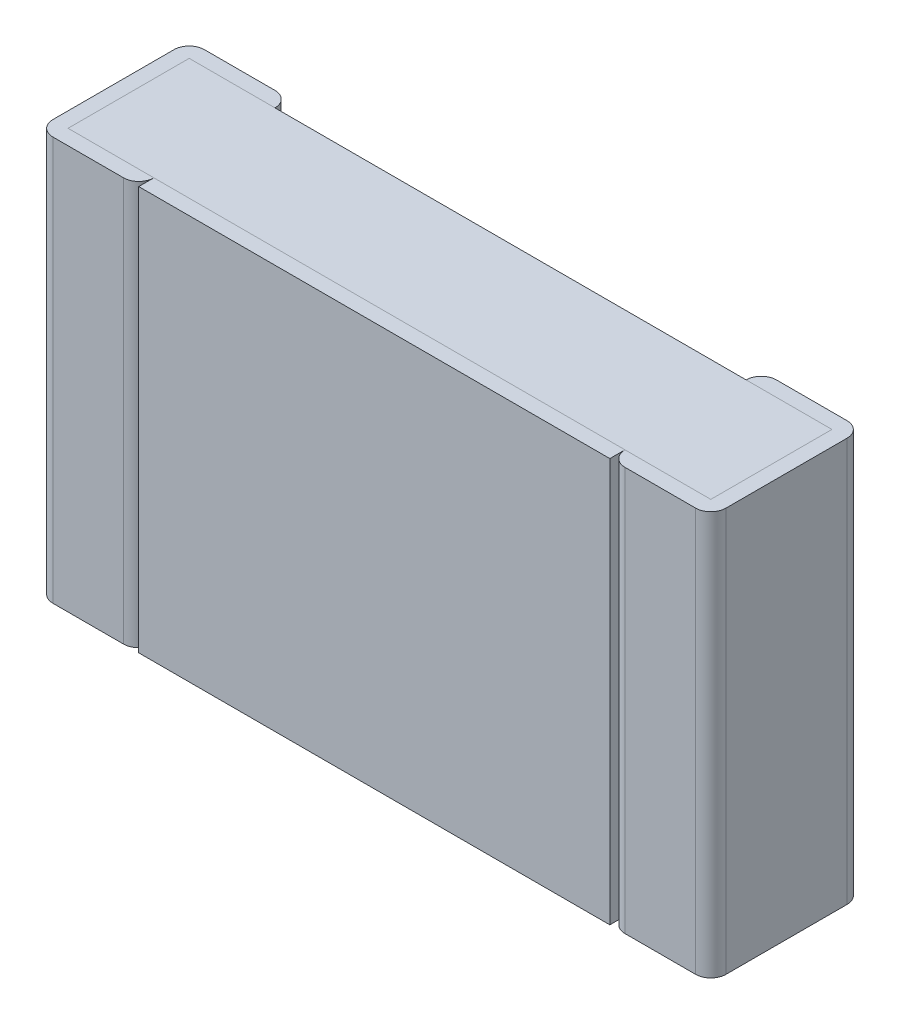
ISO-10303-21;
HEADER;
FILE_DESCRIPTION(('STEP AP214'),'2;1');
FILE_NAME('part.step','',(''),(''),'','','');
FILE_SCHEMA(('AUTOMOTIVE_DESIGN { 1 0 10303 214 1 1 1 1 }'));
ENDSEC;
DATA;
#1=APPLICATION_CONTEXT('core data for automotive mechanical design processes');
#2=APPLICATION_PROTOCOL_DEFINITION('international standard','automotive_design',2000,#1);
#3=PRODUCT_CONTEXT('',#1,'mechanical');
#4=PRODUCT('Part','Part','',(#3));
#5=PRODUCT_RELATED_PRODUCT_CATEGORY('part','',(#4));
#6=PRODUCT_DEFINITION_FORMATION('','',#4);
#7=PRODUCT_DEFINITION_CONTEXT('part definition',#1,'design');
#8=PRODUCT_DEFINITION('design','',#6,#7);
#9=PRODUCT_DEFINITION_SHAPE('','',#8);
#10=(LENGTH_UNIT() NAMED_UNIT(*) SI_UNIT(.MILLI.,.METRE.));
#11=(NAMED_UNIT(*) PLANE_ANGLE_UNIT() SI_UNIT($,.RADIAN.));
#12=(NAMED_UNIT(*) SI_UNIT($,.STERADIAN.) SOLID_ANGLE_UNIT());
#13=UNCERTAINTY_MEASURE_WITH_UNIT(LENGTH_MEASURE(1.E-05),#10,'distance_accuracy_value','');
#14=(GEOMETRIC_REPRESENTATION_CONTEXT(3) GLOBAL_UNCERTAINTY_ASSIGNED_CONTEXT((#13)) GLOBAL_UNIT_ASSIGNED_CONTEXT((#10,
#11,#12)) REPRESENTATION_CONTEXT('',''));
#15=CARTESIAN_POINT('',(0.,0.,0.));
#16=DIRECTION('',(0.,0.,1.));
#17=DIRECTION('',(1.,0.,0.));
#18=AXIS2_PLACEMENT_3D('',#15,#16,#17);
#19=CARTESIAN_POINT('',(-1.,-0.6,0.));
#20=DIRECTION('',(1.,0.,0.));
#21=DIRECTION('',(0.,1.,0.));
#22=AXIS2_PLACEMENT_3D('',#19,#20,#21);
#23=PLANE('',#22);
#24=DIRECTION('',(0.,1.,0.));
#25=VECTOR('',#24,1.);
#26=CARTESIAN_POINT('',(-1.,-0.6,0.405));
#27=LINE('',#26,#25);
#28=CARTESIAN_POINT('',(-1.,-0.6,0.405));
#29=VERTEX_POINT('',#28);
#30=CARTESIAN_POINT('',(-1.,0.6,0.405));
#31=VERTEX_POINT('',#30);
#32=EDGE_CURVE('E11',#29,#31,#27,.T.);
#33=ORIENTED_EDGE('',*,*,#32,.T.);
#34=DIRECTION('',(0.,0.,1.));
#35=VECTOR('',#34,1.);
#36=CARTESIAN_POINT('',(-1.,0.6,0.));
#37=LINE('',#36,#35);
#38=CARTESIAN_POINT('',(-1.,0.6,0.045));
#39=VERTEX_POINT('',#38);
#40=EDGE_CURVE('E41',#39,#31,#37,.T.);
#41=ORIENTED_EDGE('',*,*,#40,.F.);
#42=DIRECTION('',(0.,1.,0.));
#43=VECTOR('',#42,1.);
#44=CARTESIAN_POINT('',(-1.,-0.6,0.045));
#45=LINE('',#44,#43);
#46=CARTESIAN_POINT('',(-1.,-0.6,0.045));
#47=VERTEX_POINT('',#46);
#48=EDGE_CURVE('E234',#47,#39,#45,.T.);
#49=ORIENTED_EDGE('',*,*,#48,.F.);
#50=DIRECTION('',(0.,0.,1.));
#51=VECTOR('',#50,1.);
#52=CARTESIAN_POINT('',(-1.,-0.6,0.));
#53=LINE('',#52,#51);
#54=EDGE_CURVE('E27',#47,#29,#53,.T.);
#55=ORIENTED_EDGE('',*,*,#54,.T.);
#56=EDGE_LOOP('',(#33,#41,#49,#55));
#57=FACE_BOUND('',#56,.T.);
#58=ADVANCED_FACE('F16',(#57),#23,.F.);
#59=CARTESIAN_POINT('',(-1.,-0.6,0.));
#60=DIRECTION('',(0.,1.,0.));
#61=DIRECTION('',(1.,0.,0.));
#62=AXIS2_PLACEMENT_3D('',#59,#60,#61);
#63=PLANE('',#62);
#64=CARTESIAN_POINT('',(-0.745,-0.6,0.045));
#65=DIRECTION('',(0.,1.,0.));
#66=DIRECTION('',(0.,0.,1.));
#67=AXIS2_PLACEMENT_3D('',#64,#65,#66);
#68=CIRCLE('',#67,0.045);
#69=CARTESIAN_POINT('',(-0.7,-0.6,0.045));
#70=VERTEX_POINT('',#69);
#71=CARTESIAN_POINT('',(-0.745,-0.6,0.));
#72=VERTEX_POINT('',#71);
#73=EDGE_CURVE('E257',#70,#72,#68,.T.);
#74=ORIENTED_EDGE('',*,*,#73,.F.);
#75=DIRECTION('',(1.,0.,0.));
#76=VECTOR('',#75,1.);
#77=CARTESIAN_POINT('',(-0.955,-0.6,0.045));
#78=LINE('',#77,#76);
#79=CARTESIAN_POINT('',(-0.955,-0.6,0.045));
#80=VERTEX_POINT('',#79);
#81=EDGE_CURVE('E186',#80,#70,#78,.T.);
#82=ORIENTED_EDGE('',*,*,#81,.F.);
#83=DIRECTION('',(0.,0.,1.));
#84=VECTOR('',#83,1.);
#85=CARTESIAN_POINT('',(-0.955,-0.6,0.045));
#86=LINE('',#85,#84);
#87=CARTESIAN_POINT('',(-0.955,-0.6,0.405));
#88=VERTEX_POINT('',#87);
#89=EDGE_CURVE('E311',#80,#88,#86,.T.);
#90=ORIENTED_EDGE('',*,*,#89,.T.);
#91=DIRECTION('',(1.,0.,0.));
#92=VECTOR('',#91,1.);
#93=CARTESIAN_POINT('',(-0.955,-0.6,0.405));
#94=LINE('',#93,#92);
#95=CARTESIAN_POINT('',(-0.7,-0.6,0.405));
#96=VERTEX_POINT('',#95);
#97=EDGE_CURVE('E308',#88,#96,#94,.T.);
#98=ORIENTED_EDGE('',*,*,#97,.T.);
#99=CARTESIAN_POINT('',(-0.745,-0.6,0.405));
#100=DIRECTION('',(0.,-1.,0.));
#101=DIRECTION('',(0.,0.,1.));
#102=AXIS2_PLACEMENT_3D('',#99,#100,#101);
#103=CIRCLE('',#102,0.045);
#104=CARTESIAN_POINT('',(-0.745,-0.6,0.45));
#105=VERTEX_POINT('',#104);
#106=EDGE_CURVE('E180',#96,#105,#103,.T.);
#107=ORIENTED_EDGE('',*,*,#106,.T.);
#108=DIRECTION('',(1.,0.,0.));
#109=VECTOR('',#108,1.);
#110=CARTESIAN_POINT('',(-1.,-0.6,0.45));
#111=LINE('',#110,#109);
#112=CARTESIAN_POINT('',(-0.955,-0.6,0.45));
#113=VERTEX_POINT('',#112);
#114=EDGE_CURVE('E172',#113,#105,#111,.T.);
#115=ORIENTED_EDGE('',*,*,#114,.F.);
#116=CARTESIAN_POINT('',(-0.955,-0.6,0.405));
#117=DIRECTION('',(0.,1.,0.));
#118=DIRECTION('',(0.,0.,1.));
#119=AXIS2_PLACEMENT_3D('',#116,#117,#118);
#120=CIRCLE('',#119,0.045);
#121=EDGE_CURVE('E177',#29,#113,#120,.T.);
#122=ORIENTED_EDGE('',*,*,#121,.F.);
#123=ORIENTED_EDGE('',*,*,#54,.F.);
#124=CARTESIAN_POINT('',(-0.955,-0.6,0.045));
#125=DIRECTION('',(0.,-1.,0.));
#126=DIRECTION('',(0.,0.,1.));
#127=AXIS2_PLACEMENT_3D('',#124,#125,#126);
#128=CIRCLE('',#127,0.045);
#129=CARTESIAN_POINT('',(-0.955,-0.6,0.));
#130=VERTEX_POINT('',#129);
#131=EDGE_CURVE('E357',#47,#130,#128,.T.);
#132=ORIENTED_EDGE('',*,*,#131,.T.);
#133=DIRECTION('',(1.,0.,0.));
#134=VECTOR('',#133,1.);
#135=CARTESIAN_POINT('',(-1.,-0.6,0.));
#136=LINE('',#135,#134);
#137=EDGE_CURVE('E164',#130,#72,#136,.T.);
#138=ORIENTED_EDGE('',*,*,#137,.T.);
#139=EDGE_LOOP('',(#74,#82,#90,#98,#107,#115,#122,#123,#132,#138));
#140=FACE_BOUND('',#139,.T.);
#141=ADVANCED_FACE('F175',(#140),#63,.F.);
#142=CARTESIAN_POINT('',(-0.955,-0.6,0.045));
#143=DIRECTION('',(0.,1.,0.));
#144=DIRECTION('',(-1.,0.,0.));
#145=AXIS2_PLACEMENT_3D('',#142,#143,#144);
#146=CYLINDRICAL_SURFACE('',#145,0.045);
#147=ORIENTED_EDGE('',*,*,#48,.T.);
#148=CARTESIAN_POINT('',(-0.955,0.6,0.045));
#149=DIRECTION('',(0.,-1.,0.));
#150=DIRECTION('',(0.,0.,1.));
#151=AXIS2_PLACEMENT_3D('',#148,#149,#150);
#152=CIRCLE('',#151,0.045);
#153=CARTESIAN_POINT('',(-0.955,0.6,0.));
#154=VERTEX_POINT('',#153);
#155=EDGE_CURVE('E197',#39,#154,#152,.T.);
#156=ORIENTED_EDGE('',*,*,#155,.T.);
#157=DIRECTION('',(0.,1.,0.));
#158=VECTOR('',#157,1.);
#159=CARTESIAN_POINT('',(-0.955,-0.6,0.));
#160=LINE('',#159,#158);
#161=EDGE_CURVE('E256',#130,#154,#160,.T.);
#162=ORIENTED_EDGE('',*,*,#161,.F.);
#163=ORIENTED_EDGE('',*,*,#131,.F.);
#164=EDGE_LOOP('',(#147,#156,#162,#163));
#165=FACE_BOUND('',#164,.T.);
#166=ADVANCED_FACE('F429',(#165),#146,.T.);
#167=CARTESIAN_POINT('',(-0.955,-0.6,0.405));
#168=DIRECTION('',(0.,1.,0.));
#169=DIRECTION('',(-1.,0.,0.));
#170=AXIS2_PLACEMENT_3D('',#167,#168,#169);
#171=CYLINDRICAL_SURFACE('',#170,0.045);
#172=ORIENTED_EDGE('',*,*,#121,.T.);
#173=DIRECTION('',(0.,1.,0.));
#174=VECTOR('',#173,1.);
#175=CARTESIAN_POINT('',(-0.955,-0.6,0.45));
#176=LINE('',#175,#174);
#177=CARTESIAN_POINT('',(-0.955,0.6,0.45));
#178=VERTEX_POINT('',#177);
#179=EDGE_CURVE('E194',#113,#178,#176,.T.);
#180=ORIENTED_EDGE('',*,*,#179,.T.);
#181=CARTESIAN_POINT('',(-0.955,0.6,0.405));
#182=DIRECTION('',(0.,1.,0.));
#183=DIRECTION('',(0.,0.,1.));
#184=AXIS2_PLACEMENT_3D('',#181,#182,#183);
#185=CIRCLE('',#184,0.045);
#186=EDGE_CURVE('E208',#31,#178,#185,.T.);
#187=ORIENTED_EDGE('',*,*,#186,.F.);
#188=ORIENTED_EDGE('',*,*,#32,.F.);
#189=EDGE_LOOP('',(#172,#180,#187,#188));
#190=FACE_BOUND('',#189,.T.);
#191=ADVANCED_FACE('F192',(#190),#171,.T.);
#192=CARTESIAN_POINT('',(-1.,0.6,0.));
#193=DIRECTION('',(0.,1.,0.));
#194=DIRECTION('',(1.,0.,0.));
#195=AXIS2_PLACEMENT_3D('',#192,#193,#194);
#196=PLANE('',#195);
#197=DIRECTION('',(1.,0.,0.));
#198=VECTOR('',#197,1.);
#199=CARTESIAN_POINT('',(-1.,0.6,0.));
#200=LINE('',#199,#198);
#201=CARTESIAN_POINT('',(-0.745,0.6,0.));
#202=VERTEX_POINT('',#201);
#203=EDGE_CURVE('E253',#154,#202,#200,.T.);
#204=ORIENTED_EDGE('',*,*,#203,.F.);
#205=ORIENTED_EDGE('',*,*,#155,.F.);
#206=ORIENTED_EDGE('',*,*,#40,.T.);
#207=ORIENTED_EDGE('',*,*,#186,.T.);
#208=DIRECTION('',(1.,0.,0.));
#209=VECTOR('',#208,1.);
#210=CARTESIAN_POINT('',(-1.,0.6,0.45));
#211=LINE('',#210,#209);
#212=CARTESIAN_POINT('',(-0.745,0.6,0.45));
#213=VERTEX_POINT('',#212);
#214=EDGE_CURVE('E201',#178,#213,#211,.T.);
#215=ORIENTED_EDGE('',*,*,#214,.T.);
#216=CARTESIAN_POINT('',(-0.745,0.6,0.405));
#217=DIRECTION('',(0.,-1.,0.));
#218=DIRECTION('',(0.,0.,1.));
#219=AXIS2_PLACEMENT_3D('',#216,#217,#218);
#220=CIRCLE('',#219,0.045);
#221=CARTESIAN_POINT('',(-0.7,0.6,0.405));
#222=VERTEX_POINT('',#221);
#223=EDGE_CURVE('E268',#222,#213,#220,.T.);
#224=ORIENTED_EDGE('',*,*,#223,.F.);
#225=DIRECTION('',(1.,0.,0.));
#226=VECTOR('',#225,1.);
#227=CARTESIAN_POINT('',(-0.955,0.6,0.405));
#228=LINE('',#227,#226);
#229=CARTESIAN_POINT('',(-0.955,0.6,0.405));
#230=VERTEX_POINT('',#229);
#231=EDGE_CURVE('E245',#230,#222,#228,.T.);
#232=ORIENTED_EDGE('',*,*,#231,.F.);
#233=DIRECTION('',(0.,0.,1.));
#234=VECTOR('',#233,1.);
#235=CARTESIAN_POINT('',(-0.955,0.6,0.045));
#236=LINE('',#235,#234);
#237=CARTESIAN_POINT('',(-0.955,0.6,0.045));
#238=VERTEX_POINT('',#237);
#239=EDGE_CURVE('E272',#238,#230,#236,.T.);
#240=ORIENTED_EDGE('',*,*,#239,.F.);
#241=DIRECTION('',(1.,0.,0.));
#242=VECTOR('',#241,1.);
#243=CARTESIAN_POINT('',(-0.955,0.6,0.045));
#244=LINE('',#243,#242);
#245=CARTESIAN_POINT('',(-0.7,0.6,0.045));
#246=VERTEX_POINT('',#245);
#247=EDGE_CURVE('E410',#238,#246,#244,.T.);
#248=ORIENTED_EDGE('',*,*,#247,.T.);
#249=CARTESIAN_POINT('',(-0.745,0.6,0.045));
#250=DIRECTION('',(0.,1.,0.));
#251=DIRECTION('',(0.,0.,1.));
#252=AXIS2_PLACEMENT_3D('',#249,#250,#251);
#253=CIRCLE('',#252,0.045);
#254=EDGE_CURVE('E339',#246,#202,#253,.T.);
#255=ORIENTED_EDGE('',*,*,#254,.T.);
#256=EDGE_LOOP('',(#204,#205,#206,#207,#215,#224,#232,#240,#248,#255));
#257=FACE_BOUND('',#256,.T.);
#258=ADVANCED_FACE('F422',(#257),#196,.T.);
#259=CARTESIAN_POINT('',(-1.,-0.6,0.));
#260=DIRECTION('',(0.,0.,1.));
#261=DIRECTION('',(1.,0.,0.));
#262=AXIS2_PLACEMENT_3D('',#259,#260,#261);
#263=PLANE('',#262);
#264=DIRECTION('',(0.,1.,0.));
#265=VECTOR('',#264,1.);
#266=CARTESIAN_POINT('',(-0.745,-0.6,0.));
#267=LINE('',#266,#265);
#268=EDGE_CURVE('E263',#72,#202,#267,.T.);
#269=ORIENTED_EDGE('',*,*,#268,.F.);
#270=ORIENTED_EDGE('',*,*,#137,.F.);
#271=ORIENTED_EDGE('',*,*,#161,.T.);
#272=ORIENTED_EDGE('',*,*,#203,.T.);
#273=EDGE_LOOP('',(#269,#270,#271,#272));
#274=FACE_BOUND('',#273,.T.);
#275=ADVANCED_FACE('F425',(#274),#263,.F.);
#276=CARTESIAN_POINT('',(-0.745,-0.6,0.045));
#277=DIRECTION('',(0.,1.,0.));
#278=DIRECTION('',(1.,0.,0.));
#279=AXIS2_PLACEMENT_3D('',#276,#277,#278);
#280=CYLINDRICAL_SURFACE('',#279,0.045);
#281=ORIENTED_EDGE('',*,*,#73,.T.);
#282=ORIENTED_EDGE('',*,*,#268,.T.);
#283=ORIENTED_EDGE('',*,*,#254,.F.);
#284=DIRECTION('',(0.,1.,0.));
#285=VECTOR('',#284,1.);
#286=CARTESIAN_POINT('',(-0.7,-0.6,0.045));
#287=LINE('',#286,#285);
#288=EDGE_CURVE('E239',#70,#246,#287,.T.);
#289=ORIENTED_EDGE('',*,*,#288,.F.);
#290=EDGE_LOOP('',(#281,#282,#283,#289));
#291=FACE_BOUND('',#290,.T.);
#292=ADVANCED_FACE('F424',(#291),#280,.T.);
#293=CARTESIAN_POINT('',(-0.955,-0.6,0.045));
#294=DIRECTION('',(0.,1.,0.));
#295=DIRECTION('',(1.,0.,0.));
#296=AXIS2_PLACEMENT_3D('',#293,#294,#295);
#297=PLANE('',#296);
#298=DIRECTION('',(1.,0.,0.));
#299=VECTOR('',#298,1.);
#300=CARTESIAN_POINT('',(-0.955,-0.6,0.045));
#301=LINE('',#300,#299);
#302=CARTESIAN_POINT('',(0.7,-0.6,0.045));
#303=VERTEX_POINT('',#302);
#304=EDGE_CURVE('E267',#70,#303,#301,.T.);
#305=ORIENTED_EDGE('',*,*,#304,.T.);
#306=DIRECTION('',(1.,0.,0.));
#307=VECTOR('',#306,1.);
#308=CARTESIAN_POINT('',(-0.955,-0.6,0.045));
#309=LINE('',#308,#307);
#310=CARTESIAN_POINT('',(0.955,-0.6,0.045));
#311=VERTEX_POINT('',#310);
#312=EDGE_CURVE('E365',#303,#311,#309,.T.);
#313=ORIENTED_EDGE('',*,*,#312,.T.);
#314=DIRECTION('',(0.,0.,1.));
#315=VECTOR('',#314,1.);
#316=CARTESIAN_POINT('',(0.955,-0.6,0.045));
#317=LINE('',#316,#315);
#318=CARTESIAN_POINT('',(0.955,-0.6,0.405));
#319=VERTEX_POINT('',#318);
#320=EDGE_CURVE('E368',#311,#319,#317,.T.);
#321=ORIENTED_EDGE('',*,*,#320,.T.);
#322=DIRECTION('',(1.,0.,0.));
#323=VECTOR('',#322,1.);
#324=CARTESIAN_POINT('',(-0.955,-0.6,0.405));
#325=LINE('',#324,#323);
#326=CARTESIAN_POINT('',(0.7,-0.6,0.405));
#327=VERTEX_POINT('',#326);
#328=EDGE_CURVE('E283',#327,#319,#325,.T.);
#329=ORIENTED_EDGE('',*,*,#328,.F.);
#330=DIRECTION('',(1.,0.,0.));
#331=VECTOR('',#330,1.);
#332=CARTESIAN_POINT('',(-0.7,-0.6,0.405));
#333=LINE('',#332,#331);
#334=EDGE_CURVE('E306',#96,#327,#333,.T.);
#335=ORIENTED_EDGE('',*,*,#334,.F.);
#336=ORIENTED_EDGE('',*,*,#97,.F.);
#337=ORIENTED_EDGE('',*,*,#89,.F.);
#338=ORIENTED_EDGE('',*,*,#81,.T.);
#339=EDGE_LOOP('',(#305,#313,#321,#329,#335,#336,#337,#338));
#340=FACE_BOUND('',#339,.T.);
#341=ADVANCED_FACE('F478',(#340),#297,.F.);
#342=CARTESIAN_POINT('',(-1.,-0.6,0.45));
#343=DIRECTION('',(0.,0.,1.));
#344=DIRECTION('',(1.,0.,0.));
#345=AXIS2_PLACEMENT_3D('',#342,#343,#344);
#346=PLANE('',#345);
#347=ORIENTED_EDGE('',*,*,#214,.F.);
#348=ORIENTED_EDGE('',*,*,#179,.F.);
#349=ORIENTED_EDGE('',*,*,#114,.T.);
#350=DIRECTION('',(0.,1.,0.));
#351=VECTOR('',#350,1.);
#352=CARTESIAN_POINT('',(-0.745,-0.6,0.45));
#353=LINE('',#352,#351);
#354=EDGE_CURVE('E187',#105,#213,#353,.T.);
#355=ORIENTED_EDGE('',*,*,#354,.T.);
#356=EDGE_LOOP('',(#347,#348,#349,#355));
#357=FACE_BOUND('',#356,.T.);
#358=ADVANCED_FACE('F199',(#357),#346,.T.);
#359=CARTESIAN_POINT('',(-0.745,-0.6,0.405));
#360=DIRECTION('',(0.,1.,0.));
#361=DIRECTION('',(1.,0.,0.));
#362=AXIS2_PLACEMENT_3D('',#359,#360,#361);
#363=CYLINDRICAL_SURFACE('',#362,0.045);
#364=DIRECTION('',(0.,1.,0.));
#365=VECTOR('',#364,1.);
#366=CARTESIAN_POINT('',(-0.7,-0.6,0.405));
#367=LINE('',#366,#365);
#368=EDGE_CURVE('E271',#96,#222,#367,.T.);
#369=ORIENTED_EDGE('',*,*,#368,.T.);
#370=ORIENTED_EDGE('',*,*,#223,.T.);
#371=ORIENTED_EDGE('',*,*,#354,.F.);
#372=ORIENTED_EDGE('',*,*,#106,.F.);
#373=EDGE_LOOP('',(#369,#370,#371,#372));
#374=FACE_BOUND('',#373,.T.);
#375=ADVANCED_FACE('F511',(#374),#363,.T.);
#376=CARTESIAN_POINT('',(-0.955,0.6,0.045));
#377=DIRECTION('',(0.,1.,0.));
#378=DIRECTION('',(1.,0.,0.));
#379=AXIS2_PLACEMENT_3D('',#376,#377,#378);
#380=PLANE('',#379);
#381=ORIENTED_EDGE('',*,*,#247,.F.);
#382=ORIENTED_EDGE('',*,*,#239,.T.);
#383=ORIENTED_EDGE('',*,*,#231,.T.);
#384=DIRECTION('',(1.,0.,0.));
#385=VECTOR('',#384,1.);
#386=CARTESIAN_POINT('',(-0.7,0.6,0.405));
#387=LINE('',#386,#385);
#388=CARTESIAN_POINT('',(0.7,0.6,0.405));
#389=VERTEX_POINT('',#388);
#390=EDGE_CURVE('E241',#222,#389,#387,.T.);
#391=ORIENTED_EDGE('',*,*,#390,.T.);
#392=DIRECTION('',(1.,0.,0.));
#393=VECTOR('',#392,1.);
#394=CARTESIAN_POINT('',(-0.955,0.6,0.405));
#395=LINE('',#394,#393);
#396=CARTESIAN_POINT('',(0.955,0.6,0.405));
#397=VERTEX_POINT('',#396);
#398=EDGE_CURVE('E246',#389,#397,#395,.T.);
#399=ORIENTED_EDGE('',*,*,#398,.T.);
#400=DIRECTION('',(0.,0.,1.));
#401=VECTOR('',#400,1.);
#402=CARTESIAN_POINT('',(0.955,0.6,0.045));
#403=LINE('',#402,#401);
#404=CARTESIAN_POINT('',(0.955,0.6,0.045));
#405=VERTEX_POINT('',#404);
#406=EDGE_CURVE('E230',#405,#397,#403,.T.);
#407=ORIENTED_EDGE('',*,*,#406,.F.);
#408=DIRECTION('',(1.,0.,0.));
#409=VECTOR('',#408,1.);
#410=CARTESIAN_POINT('',(-0.955,0.6,0.045));
#411=LINE('',#410,#409);
#412=CARTESIAN_POINT('',(0.7,0.6,0.045));
#413=VERTEX_POINT('',#412);
#414=EDGE_CURVE('E315',#413,#405,#411,.T.);
#415=ORIENTED_EDGE('',*,*,#414,.F.);
#416=DIRECTION('',(1.,0.,0.));
#417=VECTOR('',#416,1.);
#418=CARTESIAN_POINT('',(-0.955,0.6,0.045));
#419=LINE('',#418,#417);
#420=EDGE_CURVE('E376',#246,#413,#419,.T.);
#421=ORIENTED_EDGE('',*,*,#420,.F.);
#422=EDGE_LOOP('',(#381,#382,#383,#391,#399,#407,#415,#421));
#423=FACE_BOUND('',#422,.T.);
#424=ADVANCED_FACE('F492',(#423),#380,.T.);
#425=CARTESIAN_POINT('',(-0.955,-0.6,0.045));
#426=DIRECTION('',(0.,0.,1.));
#427=DIRECTION('',(1.,0.,0.));
#428=AXIS2_PLACEMENT_3D('',#425,#426,#427);
#429=PLANE('',#428);
#430=ORIENTED_EDGE('',*,*,#420,.T.);
#431=DIRECTION('',(0.,1.,0.));
#432=VECTOR('',#431,1.);
#433=CARTESIAN_POINT('',(0.7,-0.6,0.045));
#434=LINE('',#433,#432);
#435=EDGE_CURVE('E221',#303,#413,#434,.T.);
#436=ORIENTED_EDGE('',*,*,#435,.F.);
#437=ORIENTED_EDGE('',*,*,#304,.F.);
#438=ORIENTED_EDGE('',*,*,#288,.T.);
#439=EDGE_LOOP('',(#430,#436,#437,#438));
#440=FACE_BOUND('',#439,.T.);
#441=ADVANCED_FACE('F517',(#440),#429,.F.);
#442=CARTESIAN_POINT('',(0.7,-0.6,0.));
#443=DIRECTION('',(0.,1.,0.));
#444=DIRECTION('',(1.,0.,0.));
#445=AXIS2_PLACEMENT_3D('',#442,#443,#444);
#446=PLANE('',#445);
#447=CARTESIAN_POINT('',(0.955,-0.6,0.045));
#448=DIRECTION('',(0.,1.,0.));
#449=DIRECTION('',(0.,0.,1.));
#450=AXIS2_PLACEMENT_3D('',#447,#448,#449);
#451=CIRCLE('',#450,0.045);
#452=CARTESIAN_POINT('',(1.,-0.6,0.045));
#453=VERTEX_POINT('',#452);
#454=CARTESIAN_POINT('',(0.955,-0.6,0.));
#455=VERTEX_POINT('',#454);
#456=EDGE_CURVE('E258',#453,#455,#451,.T.);
#457=ORIENTED_EDGE('',*,*,#456,.F.);
#458=DIRECTION('',(0.,0.,1.));
#459=VECTOR('',#458,1.);
#460=CARTESIAN_POINT('',(1.,-0.6,0.));
#461=LINE('',#460,#459);
#462=CARTESIAN_POINT('',(1.,-0.6,0.405));
#463=VERTEX_POINT('',#462);
#464=EDGE_CURVE('E235',#453,#463,#461,.T.);
#465=ORIENTED_EDGE('',*,*,#464,.T.);
#466=CARTESIAN_POINT('',(0.955,-0.6,0.405));
#467=DIRECTION('',(0.,-1.,0.));
#468=DIRECTION('',(0.,0.,1.));
#469=AXIS2_PLACEMENT_3D('',#466,#467,#468);
#470=CIRCLE('',#469,0.045);
#471=CARTESIAN_POINT('',(0.955,-0.6,0.45));
#472=VERTEX_POINT('',#471);
#473=EDGE_CURVE('E240',#463,#472,#470,.T.);
#474=ORIENTED_EDGE('',*,*,#473,.T.);
#475=DIRECTION('',(1.,0.,0.));
#476=VECTOR('',#475,1.);
#477=CARTESIAN_POINT('',(0.7,-0.6,0.45));
#478=LINE('',#477,#476);
#479=CARTESIAN_POINT('',(0.745,-0.6,0.45));
#480=VERTEX_POINT('',#479);
#481=EDGE_CURVE('E252',#480,#472,#478,.T.);
#482=ORIENTED_EDGE('',*,*,#481,.F.);
#483=CARTESIAN_POINT('',(0.745,-0.6,0.405));
#484=DIRECTION('',(0.,1.,0.));
#485=DIRECTION('',(0.,0.,1.));
#486=AXIS2_PLACEMENT_3D('',#483,#484,#485);
#487=CIRCLE('',#486,0.045);
#488=EDGE_CURVE('E279',#327,#480,#487,.T.);
#489=ORIENTED_EDGE('',*,*,#488,.F.);
#490=ORIENTED_EDGE('',*,*,#328,.T.);
#491=ORIENTED_EDGE('',*,*,#320,.F.);
#492=ORIENTED_EDGE('',*,*,#312,.F.);
#493=CARTESIAN_POINT('',(0.745,-0.6,0.045));
#494=DIRECTION('',(0.,-1.,0.));
#495=DIRECTION('',(0.,0.,1.));
#496=AXIS2_PLACEMENT_3D('',#493,#494,#495);
#497=CIRCLE('',#496,0.045);
#498=CARTESIAN_POINT('',(0.745,-0.6,0.));
#499=VERTEX_POINT('',#498);
#500=EDGE_CURVE('E219',#303,#499,#497,.T.);
#501=ORIENTED_EDGE('',*,*,#500,.T.);
#502=DIRECTION('',(1.,0.,0.));
#503=VECTOR('',#502,1.);
#504=CARTESIAN_POINT('',(0.7,-0.6,0.));
#505=LINE('',#504,#503);
#506=EDGE_CURVE('E215',#499,#455,#505,.T.);
#507=ORIENTED_EDGE('',*,*,#506,.T.);
#508=EDGE_LOOP('',(#457,#465,#474,#482,#489,#490,#491,#492,#501,#507));
#509=FACE_BOUND('',#508,.T.);
#510=ADVANCED_FACE('F463',(#509),#446,.F.);
#511=CARTESIAN_POINT('',(-0.7,-0.6,0.405));
#512=DIRECTION('',(0.,1.,0.));
#513=DIRECTION('',(1.,0.,0.));
#514=AXIS2_PLACEMENT_3D('',#511,#512,#513);
#515=PLANE('',#514);
#516=DIRECTION('',(0.,0.,1.));
#517=VECTOR('',#516,1.);
#518=CARTESIAN_POINT('',(0.7,-0.6,0.405));
#519=LINE('',#518,#517);
#520=CARTESIAN_POINT('',(0.7,-0.6,0.45));
#521=VERTEX_POINT('',#520);
#522=EDGE_CURVE('E220',#327,#521,#519,.T.);
#523=ORIENTED_EDGE('',*,*,#522,.T.);
#524=DIRECTION('',(1.,0.,0.));
#525=VECTOR('',#524,1.);
#526=CARTESIAN_POINT('',(-0.7,-0.6,0.45));
#527=LINE('',#526,#525);
#528=CARTESIAN_POINT('',(-0.7,-0.6,0.45));
#529=VERTEX_POINT('',#528);
#530=EDGE_CURVE('E20',#529,#521,#527,.T.);
#531=ORIENTED_EDGE('',*,*,#530,.F.);
#532=DIRECTION('',(0.,0.,1.));
#533=VECTOR('',#532,1.);
#534=CARTESIAN_POINT('',(-0.7,-0.6,0.405));
#535=LINE('',#534,#533);
#536=EDGE_CURVE('E307',#96,#529,#535,.T.);
#537=ORIENTED_EDGE('',*,*,#536,.F.);
#538=ORIENTED_EDGE('',*,*,#334,.T.);
#539=EDGE_LOOP('',(#523,#531,#537,#538));
#540=FACE_BOUND('',#539,.T.);
#541=ADVANCED_FACE('F469',(#540),#515,.F.);
#542=CARTESIAN_POINT('',(-0.7,-0.6,0.405));
#543=DIRECTION('',(1.,0.,0.));
#544=DIRECTION('',(0.,1.,0.));
#545=AXIS2_PLACEMENT_3D('',#542,#543,#544);
#546=PLANE('',#545);
#547=DIRECTION('',(0.,1.,0.));
#548=VECTOR('',#547,1.);
#549=CARTESIAN_POINT('',(-0.7,-0.6,0.45));
#550=LINE('',#549,#548);
#551=CARTESIAN_POINT('',(-0.7,0.6,0.45));
#552=VERTEX_POINT('',#551);
#553=EDGE_CURVE('E303',#529,#552,#550,.T.);
#554=ORIENTED_EDGE('',*,*,#553,.T.);
#555=DIRECTION('',(0.,0.,1.));
#556=VECTOR('',#555,1.);
#557=CARTESIAN_POINT('',(-0.7,0.6,0.405));
#558=LINE('',#557,#556);
#559=EDGE_CURVE('E355',#222,#552,#558,.T.);
#560=ORIENTED_EDGE('',*,*,#559,.F.);
#561=ORIENTED_EDGE('',*,*,#368,.F.);
#562=ORIENTED_EDGE('',*,*,#536,.T.);
#563=EDGE_LOOP('',(#554,#560,#561,#562));
#564=FACE_BOUND('',#563,.T.);
#565=ADVANCED_FACE('F509',(#564),#546,.F.);
#566=CARTESIAN_POINT('',(0.7,0.6,0.));
#567=DIRECTION('',(0.,1.,0.));
#568=DIRECTION('',(1.,0.,0.));
#569=AXIS2_PLACEMENT_3D('',#566,#567,#568);
#570=PLANE('',#569);
#571=DIRECTION('',(1.,0.,0.));
#572=VECTOR('',#571,1.);
#573=CARTESIAN_POINT('',(0.7,0.6,0.));
#574=LINE('',#573,#572);
#575=CARTESIAN_POINT('',(0.745,0.6,0.));
#576=VERTEX_POINT('',#575);
#577=CARTESIAN_POINT('',(0.955,0.6,0.));
#578=VERTEX_POINT('',#577);
#579=EDGE_CURVE('E261',#576,#578,#574,.T.);
#580=ORIENTED_EDGE('',*,*,#579,.F.);
#581=CARTESIAN_POINT('',(0.745,0.6,0.045));
#582=DIRECTION('',(0.,-1.,0.));
#583=DIRECTION('',(0.,0.,1.));
#584=AXIS2_PLACEMENT_3D('',#581,#582,#583);
#585=CIRCLE('',#584,0.045);
#586=EDGE_CURVE('E225',#413,#576,#585,.T.);
#587=ORIENTED_EDGE('',*,*,#586,.F.);
#588=ORIENTED_EDGE('',*,*,#414,.T.);
#589=ORIENTED_EDGE('',*,*,#406,.T.);
#590=ORIENTED_EDGE('',*,*,#398,.F.);
#591=CARTESIAN_POINT('',(0.745,0.6,0.405));
#592=DIRECTION('',(0.,1.,0.));
#593=DIRECTION('',(0.,0.,1.));
#594=AXIS2_PLACEMENT_3D('',#591,#592,#593);
#595=CIRCLE('',#594,0.045);
#596=CARTESIAN_POINT('',(0.745,0.6,0.45));
#597=VERTEX_POINT('',#596);
#598=EDGE_CURVE('E226',#389,#597,#595,.T.);
#599=ORIENTED_EDGE('',*,*,#598,.T.);
#600=DIRECTION('',(1.,0.,0.));
#601=VECTOR('',#600,1.);
#602=CARTESIAN_POINT('',(0.7,0.6,0.45));
#603=LINE('',#602,#601);
#604=CARTESIAN_POINT('',(0.955,0.6,0.45));
#605=VERTEX_POINT('',#604);
#606=EDGE_CURVE('E212',#597,#605,#603,.T.);
#607=ORIENTED_EDGE('',*,*,#606,.T.);
#608=CARTESIAN_POINT('',(0.955,0.6,0.405));
#609=DIRECTION('',(0.,-1.,0.));
#610=DIRECTION('',(0.,0.,1.));
#611=AXIS2_PLACEMENT_3D('',#608,#609,#610);
#612=CIRCLE('',#611,0.045);
#613=CARTESIAN_POINT('',(1.,0.6,0.405));
#614=VERTEX_POINT('',#613);
#615=EDGE_CURVE('E247',#614,#605,#612,.T.);
#616=ORIENTED_EDGE('',*,*,#615,.F.);
#617=DIRECTION('',(0.,0.,1.));
#618=VECTOR('',#617,1.);
#619=CARTESIAN_POINT('',(1.,0.6,0.));
#620=LINE('',#619,#618);
#621=CARTESIAN_POINT('',(1.,0.6,0.045));
#622=VERTEX_POINT('',#621);
#623=EDGE_CURVE('E318',#622,#614,#620,.T.);
#624=ORIENTED_EDGE('',*,*,#623,.F.);
#625=CARTESIAN_POINT('',(0.955,0.6,0.045));
#626=DIRECTION('',(0.,1.,0.));
#627=DIRECTION('',(0.,0.,1.));
#628=AXIS2_PLACEMENT_3D('',#625,#626,#627);
#629=CIRCLE('',#628,0.045);
#630=EDGE_CURVE('E393',#622,#578,#629,.T.);
#631=ORIENTED_EDGE('',*,*,#630,.T.);
#632=EDGE_LOOP('',(#580,#587,#588,#589,#590,#599,#607,#616,#624,#631));
#633=FACE_BOUND('',#632,.T.);
#634=ADVANCED_FACE('F489',(#633),#570,.T.);
#635=CARTESIAN_POINT('',(-0.7,0.6,0.405));
#636=DIRECTION('',(0.,1.,0.));
#637=DIRECTION('',(1.,0.,0.));
#638=AXIS2_PLACEMENT_3D('',#635,#636,#637);
#639=PLANE('',#638);
#640=ORIENTED_EDGE('',*,*,#390,.F.);
#641=ORIENTED_EDGE('',*,*,#559,.T.);
#642=DIRECTION('',(1.,0.,0.));
#643=VECTOR('',#642,1.);
#644=CARTESIAN_POINT('',(-0.7,0.6,0.45));
#645=LINE('',#644,#643);
#646=CARTESIAN_POINT('',(0.7,0.6,0.45));
#647=VERTEX_POINT('',#646);
#648=EDGE_CURVE('E224',#552,#647,#645,.T.);
#649=ORIENTED_EDGE('',*,*,#648,.T.);
#650=DIRECTION('',(0.,0.,1.));
#651=VECTOR('',#650,1.);
#652=CARTESIAN_POINT('',(0.7,0.6,0.405));
#653=LINE('',#652,#651);
#654=EDGE_CURVE('E372',#389,#647,#653,.T.);
#655=ORIENTED_EDGE('',*,*,#654,.F.);
#656=EDGE_LOOP('',(#640,#641,#649,#655));
#657=FACE_BOUND('',#656,.T.);
#658=ADVANCED_FACE('F495',(#657),#639,.T.);
#659=CARTESIAN_POINT('',(0.745,-0.6,0.045));
#660=DIRECTION('',(0.,1.,0.));
#661=DIRECTION('',(-1.,0.,0.));
#662=AXIS2_PLACEMENT_3D('',#659,#660,#661);
#663=CYLINDRICAL_SURFACE('',#662,0.045);
#664=ORIENTED_EDGE('',*,*,#435,.T.);
#665=ORIENTED_EDGE('',*,*,#586,.T.);
#666=DIRECTION('',(0.,1.,0.));
#667=VECTOR('',#666,1.);
#668=CARTESIAN_POINT('',(0.745,-0.6,0.));
#669=LINE('',#668,#667);
#670=EDGE_CURVE('E275',#499,#576,#669,.T.);
#671=ORIENTED_EDGE('',*,*,#670,.F.);
#672=ORIENTED_EDGE('',*,*,#500,.F.);
#673=EDGE_LOOP('',(#664,#665,#671,#672));
#674=FACE_BOUND('',#673,.T.);
#675=ADVANCED_FACE('F529',(#674),#663,.T.);
#676=CARTESIAN_POINT('',(0.7,-0.6,0.));
#677=DIRECTION('',(0.,0.,1.));
#678=DIRECTION('',(1.,0.,0.));
#679=AXIS2_PLACEMENT_3D('',#676,#677,#678);
#680=PLANE('',#679);
#681=DIRECTION('',(0.,1.,0.));
#682=VECTOR('',#681,1.);
#683=CARTESIAN_POINT('',(0.955,-0.6,0.));
#684=LINE('',#683,#682);
#685=EDGE_CURVE('E262',#455,#578,#684,.T.);
#686=ORIENTED_EDGE('',*,*,#685,.F.);
#687=ORIENTED_EDGE('',*,*,#506,.F.);
#688=ORIENTED_EDGE('',*,*,#670,.T.);
#689=ORIENTED_EDGE('',*,*,#579,.T.);
#690=EDGE_LOOP('',(#686,#687,#688,#689));
#691=FACE_BOUND('',#690,.T.);
#692=ADVANCED_FACE('F531',(#691),#680,.F.);
#693=CARTESIAN_POINT('',(0.955,-0.6,0.045));
#694=DIRECTION('',(0.,1.,0.));
#695=DIRECTION('',(1.,0.,0.));
#696=AXIS2_PLACEMENT_3D('',#693,#694,#695);
#697=CYLINDRICAL_SURFACE('',#696,0.045);
#698=ORIENTED_EDGE('',*,*,#456,.T.);
#699=ORIENTED_EDGE('',*,*,#685,.T.);
#700=ORIENTED_EDGE('',*,*,#630,.F.);
#701=DIRECTION('',(0.,1.,0.));
#702=VECTOR('',#701,1.);
#703=CARTESIAN_POINT('',(1.,-0.6,0.045));
#704=LINE('',#703,#702);
#705=EDGE_CURVE('E321',#453,#622,#704,.T.);
#706=ORIENTED_EDGE('',*,*,#705,.F.);
#707=EDGE_LOOP('',(#698,#699,#700,#706));
#708=FACE_BOUND('',#707,.T.);
#709=ADVANCED_FACE('F664',(#708),#697,.T.);
#710=CARTESIAN_POINT('',(1.,-0.6,0.));
#711=DIRECTION('',(1.,0.,0.));
#712=DIRECTION('',(0.,1.,0.));
#713=AXIS2_PLACEMENT_3D('',#710,#711,#712);
#714=PLANE('',#713);
#715=ORIENTED_EDGE('',*,*,#464,.F.);
#716=ORIENTED_EDGE('',*,*,#705,.T.);
#717=ORIENTED_EDGE('',*,*,#623,.T.);
#718=DIRECTION('',(0.,1.,0.));
#719=VECTOR('',#718,1.);
#720=CARTESIAN_POINT('',(1.,-0.6,0.405));
#721=LINE('',#720,#719);
#722=EDGE_CURVE('E251',#463,#614,#721,.T.);
#723=ORIENTED_EDGE('',*,*,#722,.F.);
#724=EDGE_LOOP('',(#715,#716,#717,#723));
#725=FACE_BOUND('',#724,.T.);
#726=ADVANCED_FACE('F630',(#725),#714,.T.);
#727=CARTESIAN_POINT('',(0.955,-0.6,0.405));
#728=DIRECTION('',(0.,1.,0.));
#729=DIRECTION('',(1.,0.,0.));
#730=AXIS2_PLACEMENT_3D('',#727,#728,#729);
#731=CYLINDRICAL_SURFACE('',#730,0.045);
#732=ORIENTED_EDGE('',*,*,#722,.T.);
#733=ORIENTED_EDGE('',*,*,#615,.T.);
#734=DIRECTION('',(0.,1.,0.));
#735=VECTOR('',#734,1.);
#736=CARTESIAN_POINT('',(0.955,-0.6,0.45));
#737=LINE('',#736,#735);
#738=EDGE_CURVE('E341',#472,#605,#737,.T.);
#739=ORIENTED_EDGE('',*,*,#738,.F.);
#740=ORIENTED_EDGE('',*,*,#473,.F.);
#741=EDGE_LOOP('',(#732,#733,#739,#740));
#742=FACE_BOUND('',#741,.T.);
#743=ADVANCED_FACE('F572',(#742),#731,.T.);
#744=CARTESIAN_POINT('',(0.7,-0.6,0.45));
#745=DIRECTION('',(0.,0.,1.));
#746=DIRECTION('',(1.,0.,0.));
#747=AXIS2_PLACEMENT_3D('',#744,#745,#746);
#748=PLANE('',#747);
#749=ORIENTED_EDGE('',*,*,#606,.F.);
#750=DIRECTION('',(0.,1.,0.));
#751=VECTOR('',#750,1.);
#752=CARTESIAN_POINT('',(0.745,-0.6,0.45));
#753=LINE('',#752,#751);
#754=EDGE_CURVE('E276',#480,#597,#753,.T.);
#755=ORIENTED_EDGE('',*,*,#754,.F.);
#756=ORIENTED_EDGE('',*,*,#481,.T.);
#757=ORIENTED_EDGE('',*,*,#738,.T.);
#758=EDGE_LOOP('',(#749,#755,#756,#757));
#759=FACE_BOUND('',#758,.T.);
#760=ADVANCED_FACE('F18',(#759),#748,.T.);
#761=CARTESIAN_POINT('',(0.745,-0.6,0.405));
#762=DIRECTION('',(0.,1.,0.));
#763=DIRECTION('',(-1.,0.,0.));
#764=AXIS2_PLACEMENT_3D('',#761,#762,#763);
#765=CYLINDRICAL_SURFACE('',#764,0.045);
#766=ORIENTED_EDGE('',*,*,#488,.T.);
#767=ORIENTED_EDGE('',*,*,#754,.T.);
#768=ORIENTED_EDGE('',*,*,#598,.F.);
#769=DIRECTION('',(0.,1.,0.));
#770=VECTOR('',#769,1.);
#771=CARTESIAN_POINT('',(0.7,-0.6,0.405));
#772=LINE('',#771,#770);
#773=EDGE_CURVE('E280',#327,#389,#772,.T.);
#774=ORIENTED_EDGE('',*,*,#773,.F.);
#775=EDGE_LOOP('',(#766,#767,#768,#774));
#776=FACE_BOUND('',#775,.T.);
#777=ADVANCED_FACE('F480',(#776),#765,.T.);
#778=CARTESIAN_POINT('',(0.7,-0.6,0.405));
#779=DIRECTION('',(1.,0.,0.));
#780=DIRECTION('',(0.,1.,0.));
#781=AXIS2_PLACEMENT_3D('',#778,#779,#780);
#782=PLANE('',#781);
#783=ORIENTED_EDGE('',*,*,#522,.F.);
#784=ORIENTED_EDGE('',*,*,#773,.T.);
#785=ORIENTED_EDGE('',*,*,#654,.T.);
#786=DIRECTION('',(0.,1.,0.));
#787=VECTOR('',#786,1.);
#788=CARTESIAN_POINT('',(0.7,-0.6,0.45));
#789=LINE('',#788,#787);
#790=EDGE_CURVE('E383',#521,#647,#789,.T.);
#791=ORIENTED_EDGE('',*,*,#790,.F.);
#792=EDGE_LOOP('',(#783,#784,#785,#791));
#793=FACE_BOUND('',#792,.T.);
#794=ADVANCED_FACE('F476',(#793),#782,.T.);
#795=CARTESIAN_POINT('',(-0.7,-0.6,0.45));
#796=DIRECTION('',(0.,0.,1.));
#797=DIRECTION('',(1.,0.,0.));
#798=AXIS2_PLACEMENT_3D('',#795,#796,#797);
#799=PLANE('',#798);
#800=ORIENTED_EDGE('',*,*,#553,.F.);
#801=ORIENTED_EDGE('',*,*,#530,.T.);
#802=ORIENTED_EDGE('',*,*,#790,.T.);
#803=ORIENTED_EDGE('',*,*,#648,.F.);
#804=EDGE_LOOP('',(#800,#801,#802,#803));
#805=FACE_BOUND('',#804,.T.);
#806=ADVANCED_FACE('F505',(#805),#799,.T.);
#807=CLOSED_SHELL('',(#58,#141,#166,#191,#258,#275,#292,#341,#358,#375,#424,#441,#510,#541,#565,
#634,#658,#675,#692,#709,#726,#743,#760,#777,#794,#806));
#808=MANIFOLD_SOLID_BREP('B1',#807);
#809=ADVANCED_BREP_SHAPE_REPRESENTATION('',(#18,#808),#14);
#810=SHAPE_DEFINITION_REPRESENTATION(#9,#809);
ENDSEC;
END-ISO-10303-21;
